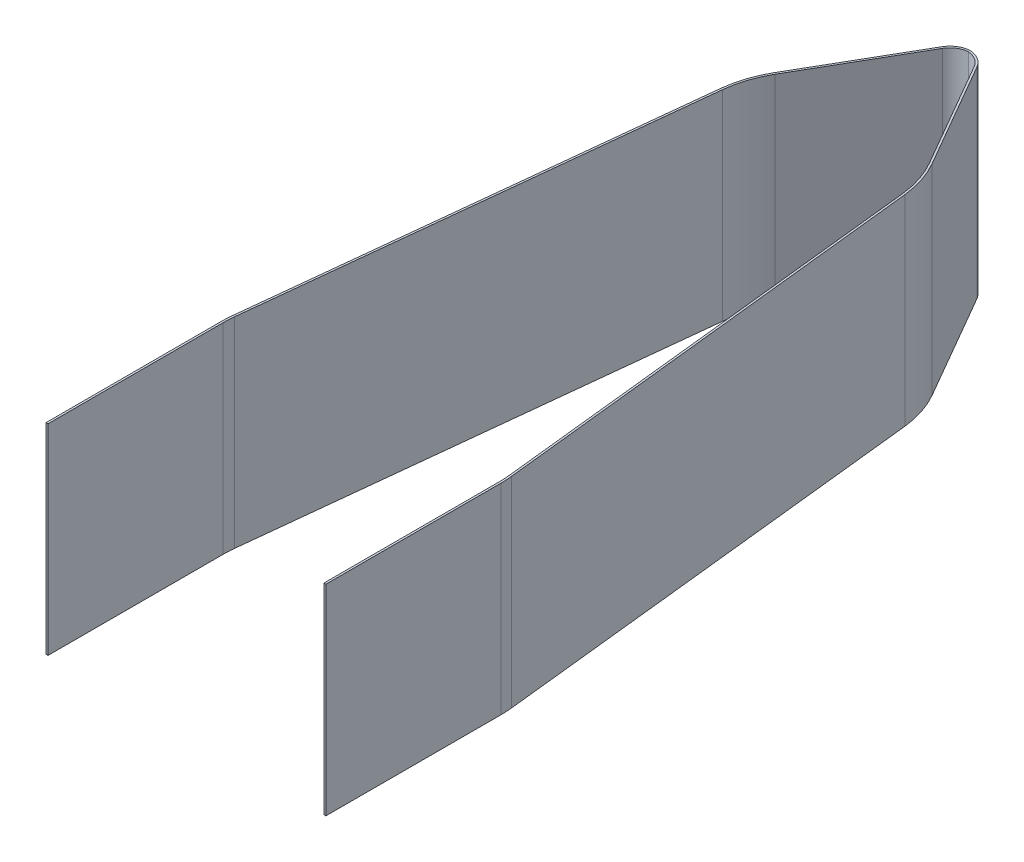
ISO-10303-21;
HEADER;
FILE_DESCRIPTION(('STEP AP214'),'2;1');
FILE_NAME('part.step','',(''),(''),'','','');
FILE_SCHEMA(('AUTOMOTIVE_DESIGN { 1 0 10303 214 1 1 1 1 }'));
ENDSEC;
DATA;
#1=APPLICATION_CONTEXT('core data for automotive mechanical design processes');
#2=APPLICATION_PROTOCOL_DEFINITION('international standard','automotive_design',2000,#1);
#3=PRODUCT_CONTEXT('',#1,'mechanical');
#4=PRODUCT('Part','Part','',(#3));
#5=PRODUCT_RELATED_PRODUCT_CATEGORY('part','',(#4));
#6=PRODUCT_DEFINITION_FORMATION('','',#4);
#7=PRODUCT_DEFINITION_CONTEXT('part definition',#1,'design');
#8=PRODUCT_DEFINITION('design','',#6,#7);
#9=PRODUCT_DEFINITION_SHAPE('','',#8);
#10=(LENGTH_UNIT() NAMED_UNIT(*) SI_UNIT(.MILLI.,.METRE.));
#11=(NAMED_UNIT(*) PLANE_ANGLE_UNIT() SI_UNIT($,.RADIAN.));
#12=(NAMED_UNIT(*) SI_UNIT($,.STERADIAN.) SOLID_ANGLE_UNIT());
#13=UNCERTAINTY_MEASURE_WITH_UNIT(LENGTH_MEASURE(1.E-05),#10,'distance_accuracy_value','');
#14=(GEOMETRIC_REPRESENTATION_CONTEXT(3) GLOBAL_UNCERTAINTY_ASSIGNED_CONTEXT((#13)) GLOBAL_UNIT_ASSIGNED_CONTEXT((#10,
#11,#12)) REPRESENTATION_CONTEXT('',''));
#15=CARTESIAN_POINT('',(0.,0.,0.));
#16=DIRECTION('',(0.,0.,1.));
#17=DIRECTION('',(1.,0.,0.));
#18=AXIS2_PLACEMENT_3D('',#15,#16,#17);
#19=CARTESIAN_POINT('',(4.7625,12.7,-24.7202799887067));
#20=DIRECTION('',(0.,-1.,0.));
#21=DIRECTION('',(0.,0.,-1.));
#22=AXIS2_PLACEMENT_3D('',#19,#20,#21);
#23=CYLINDRICAL_SURFACE('',#22,12.7);
#24=DIRECTION('',(0.,1.,0.));
#25=VECTOR('',#24,1.);
#26=CARTESIAN_POINT('',(17.4625,12.7,-24.7202799887067));
#27=LINE('',#26,#25);
#28=CARTESIAN_POINT('',(17.4625,-12.7,-24.7202799887067));
#29=VERTEX_POINT('',#28);
#30=CARTESIAN_POINT('',(17.4625,12.7,-24.7202799887067));
#31=VERTEX_POINT('',#30);
#32=EDGE_CURVE('E350',#29,#31,#27,.T.);
#33=ORIENTED_EDGE('',*,*,#32,.T.);
#34=CARTESIAN_POINT('',(4.7625,12.7,-24.7202799887067));
#35=DIRECTION('',(0.,-1.,0.));
#36=DIRECTION('',(0.,0.,-1.));
#37=AXIS2_PLACEMENT_3D('',#34,#35,#36);
#38=CIRCLE('',#37,12.7);
#39=CARTESIAN_POINT('',(17.3899488806237,12.7,-26.0758369839065));
#40=VERTEX_POINT('',#39);
#41=EDGE_CURVE('E19',#40,#31,#38,.T.);
#42=ORIENTED_EDGE('',*,*,#41,.F.);
#43=DIRECTION('',(0.,1.,0.));
#44=VECTOR('',#43,1.);
#45=CARTESIAN_POINT('',(17.3899488806237,12.7,-26.0758369839065));
#46=LINE('',#45,#44);
#47=CARTESIAN_POINT('',(17.3899488806237,-12.7,-26.0758369839065));
#48=VERTEX_POINT('',#47);
#49=EDGE_CURVE('E352',#40,#48,#46,.F.);
#50=ORIENTED_EDGE('',*,*,#49,.T.);
#51=CARTESIAN_POINT('',(4.7625,-12.7,-24.7202799887067));
#52=DIRECTION('',(0.,-1.,0.));
#53=DIRECTION('',(0.,0.,-1.));
#54=AXIS2_PLACEMENT_3D('',#51,#52,#53);
#55=CIRCLE('',#54,12.7);
#56=EDGE_CURVE('E394',#29,#48,#55,.F.);
#57=ORIENTED_EDGE('',*,*,#56,.F.);
#58=EDGE_LOOP('',(#33,#42,#50,#57));
#59=FACE_BOUND('',#58,.T.);
#60=ADVANCED_FACE('F16',(#59),#23,.F.);
#61=CARTESIAN_POINT('',(17.4625,12.7,-2.53999999999484));
#62=DIRECTION('',(0.,0.,-1.));
#63=DIRECTION('',(-1.,0.,0.));
#64=AXIS2_PLACEMENT_3D('',#61,#62,#63);
#65=PLANE('',#64);
#66=DIRECTION('',(0.,1.,0.));
#67=VECTOR('',#66,1.);
#68=CARTESIAN_POINT('',(17.7165,12.7,-2.53999999999484));
#69=LINE('',#68,#67);
#70=CARTESIAN_POINT('',(17.7165,-12.7,-2.53999999999484));
#71=VERTEX_POINT('',#70);
#72=CARTESIAN_POINT('',(17.7165,12.7,-2.53999999999484));
#73=VERTEX_POINT('',#72);
#74=EDGE_CURVE('E345',#71,#73,#69,.T.);
#75=ORIENTED_EDGE('',*,*,#74,.T.);
#76=DIRECTION('',(-1.,0.,0.));
#77=VECTOR('',#76,1.);
#78=CARTESIAN_POINT('',(17.4625,12.7,-2.53999999999484));
#79=LINE('',#78,#77);
#80=CARTESIAN_POINT('',(17.4625,12.7,-2.53999999999484));
#81=VERTEX_POINT('',#80);
#82=EDGE_CURVE('E182',#81,#73,#79,.F.);
#83=ORIENTED_EDGE('',*,*,#82,.F.);
#84=DIRECTION('',(0.,1.,0.));
#85=VECTOR('',#84,1.);
#86=CARTESIAN_POINT('',(17.4625,12.7,-2.53999999999484));
#87=LINE('',#86,#85);
#88=CARTESIAN_POINT('',(17.4625,-12.7,-2.53999999999484));
#89=VERTEX_POINT('',#88);
#90=EDGE_CURVE('E347',#81,#89,#87,.F.);
#91=ORIENTED_EDGE('',*,*,#90,.T.);
#92=DIRECTION('',(-1.,0.,0.));
#93=VECTOR('',#92,1.);
#94=CARTESIAN_POINT('',(17.4625,-12.7,-2.53999999999484));
#95=LINE('',#94,#93);
#96=EDGE_CURVE('E388',#71,#89,#95,.T.);
#97=ORIENTED_EDGE('',*,*,#96,.F.);
#98=EDGE_LOOP('',(#75,#83,#91,#97));
#99=FACE_BOUND('',#98,.T.);
#100=ADVANCED_FACE('F514',(#99),#65,.F.);
#101=CARTESIAN_POINT('',(4.7625,12.7,-24.7202799887067));
#102=DIRECTION('',(0.,-1.,0.));
#103=DIRECTION('',(0.,0.,-1.));
#104=AXIS2_PLACEMENT_3D('',#101,#102,#103);
#105=CYLINDRICAL_SURFACE('',#104,12.954);
#106=CARTESIAN_POINT('',(4.7625,12.7,-24.7202799887067));
#107=DIRECTION('',(0.,-1.,0.));
#108=DIRECTION('',(0.,0.,-1.));
#109=AXIS2_PLACEMENT_3D('',#106,#107,#108);
#110=CIRCLE('',#109,12.954);
#111=CARTESIAN_POINT('',(17.6424978582362,12.7,-26.1029481238105));
#112=VERTEX_POINT('',#111);
#113=CARTESIAN_POINT('',(17.7165,12.7,-24.7202799887067));
#114=VERTEX_POINT('',#113);
#115=EDGE_CURVE('E385',#112,#114,#110,.T.);
#116=ORIENTED_EDGE('',*,*,#115,.T.);
#117=DIRECTION('',(0.,1.,0.));
#118=VECTOR('',#117,1.);
#119=CARTESIAN_POINT('',(17.7165,12.7,-24.7202799887067));
#120=LINE('',#119,#118);
#121=CARTESIAN_POINT('',(17.7165,-12.7,-24.7202799887067));
#122=VERTEX_POINT('',#121);
#123=EDGE_CURVE('E342',#114,#122,#120,.F.);
#124=ORIENTED_EDGE('',*,*,#123,.T.);
#125=CARTESIAN_POINT('',(4.7625,-12.7,-24.7202799887067));
#126=DIRECTION('',(0.,-1.,0.));
#127=DIRECTION('',(0.,0.,-1.));
#128=AXIS2_PLACEMENT_3D('',#125,#126,#127);
#129=CIRCLE('',#128,12.954);
#130=CARTESIAN_POINT('',(17.6424978582362,-12.7,-26.1029481238105));
#131=VERTEX_POINT('',#130);
#132=EDGE_CURVE('E390',#122,#131,#129,.F.);
#133=ORIENTED_EDGE('',*,*,#132,.T.);
#134=DIRECTION('',(0.,1.,0.));
#135=VECTOR('',#134,1.);
#136=CARTESIAN_POINT('',(17.6424978582362,12.7,-26.1029481238105));
#137=LINE('',#136,#135);
#138=EDGE_CURVE('E339',#131,#112,#137,.T.);
#139=ORIENTED_EDGE('',*,*,#138,.T.);
#140=EDGE_LOOP('',(#116,#124,#133,#139));
#141=FACE_BOUND('',#140,.T.);
#142=ADVANCED_FACE('F509',(#141),#105,.T.);
#143=CARTESIAN_POINT('',(-17.4625,12.7,-2.53999999999483));
#144=DIRECTION('',(0.,0.,-1.));
#145=DIRECTION('',(-1.,0.,0.));
#146=AXIS2_PLACEMENT_3D('',#143,#144,#145);
#147=PLANE('',#146);
#148=DIRECTION('',(0.,1.,0.));
#149=VECTOR('',#148,1.);
#150=CARTESIAN_POINT('',(-17.4625,12.7,-2.53999999999483));
#151=LINE('',#150,#149);
#152=CARTESIAN_POINT('',(-17.4625,-12.7,-2.53999999999483));
#153=VERTEX_POINT('',#152);
#154=CARTESIAN_POINT('',(-17.4625,12.7,-2.53999999999483));
#155=VERTEX_POINT('',#154);
#156=EDGE_CURVE('E217',#153,#155,#151,.T.);
#157=ORIENTED_EDGE('',*,*,#156,.T.);
#158=DIRECTION('',(-1.,0.,0.));
#159=VECTOR('',#158,1.);
#160=CARTESIAN_POINT('',(-17.4625,12.7,-2.53999999999483));
#161=LINE('',#160,#159);
#162=CARTESIAN_POINT('',(-17.7165,12.7,-2.53999999999483));
#163=VERTEX_POINT('',#162);
#164=EDGE_CURVE('E209',#163,#155,#161,.F.);
#165=ORIENTED_EDGE('',*,*,#164,.F.);
#166=DIRECTION('',(0.,1.,0.));
#167=VECTOR('',#166,1.);
#168=CARTESIAN_POINT('',(-17.7165,12.7,-2.53999999999483));
#169=LINE('',#168,#167);
#170=CARTESIAN_POINT('',(-17.7165,-12.7,-2.53999999999483));
#171=VERTEX_POINT('',#170);
#172=EDGE_CURVE('E212',#163,#171,#169,.F.);
#173=ORIENTED_EDGE('',*,*,#172,.T.);
#174=DIRECTION('',(-1.,0.,0.));
#175=VECTOR('',#174,1.);
#176=CARTESIAN_POINT('',(-17.4625,-12.7,-2.53999999999483));
#177=LINE('',#176,#175);
#178=EDGE_CURVE('E198',#153,#171,#177,.T.);
#179=ORIENTED_EDGE('',*,*,#178,.F.);
#180=EDGE_LOOP('',(#157,#165,#173,#179));
#181=FACE_BOUND('',#180,.T.);
#182=ADVANCED_FACE('F213',(#181),#147,.F.);
#183=CARTESIAN_POINT('',(-4.7625,12.7,-24.7202799887067));
#184=DIRECTION('',(0.,-1.,0.));
#185=DIRECTION('',(0.,0.,-1.));
#186=AXIS2_PLACEMENT_3D('',#183,#184,#185);
#187=CYLINDRICAL_SURFACE('',#186,12.7);
#188=DIRECTION('',(0.,1.,0.));
#189=VECTOR('',#188,1.);
#190=CARTESIAN_POINT('',(-17.3899488806237,12.7,-26.0758369839065));
#191=LINE('',#190,#189);
#192=CARTESIAN_POINT('',(-17.3899488806237,-12.7,-26.0758369839065));
#193=VERTEX_POINT('',#192);
#194=CARTESIAN_POINT('',(-17.3899488806237,12.7,-26.0758369839065));
#195=VERTEX_POINT('',#194);
#196=EDGE_CURVE('E378',#193,#195,#191,.T.);
#197=ORIENTED_EDGE('',*,*,#196,.T.);
#198=CARTESIAN_POINT('',(-4.7625,12.7,-24.7202799887067));
#199=DIRECTION('',(0.,-1.,0.));
#200=DIRECTION('',(0.,0.,-1.));
#201=AXIS2_PLACEMENT_3D('',#198,#199,#200);
#202=CIRCLE('',#201,12.7);
#203=CARTESIAN_POINT('',(-17.4625,12.7,-24.7202799887067));
#204=VERTEX_POINT('',#203);
#205=EDGE_CURVE('E208',#204,#195,#202,.T.);
#206=ORIENTED_EDGE('',*,*,#205,.F.);
#207=DIRECTION('',(0.,1.,0.));
#208=VECTOR('',#207,1.);
#209=CARTESIAN_POINT('',(-17.4625,12.7,-24.7202799887067));
#210=LINE('',#209,#208);
#211=CARTESIAN_POINT('',(-17.4625,-12.7,-24.7202799887067));
#212=VERTEX_POINT('',#211);
#213=EDGE_CURVE('E318',#204,#212,#210,.F.);
#214=ORIENTED_EDGE('',*,*,#213,.T.);
#215=CARTESIAN_POINT('',(-4.7625,-12.7,-24.7202799887067));
#216=DIRECTION('',(0.,-1.,0.));
#217=DIRECTION('',(0.,0.,-1.));
#218=AXIS2_PLACEMENT_3D('',#215,#216,#217);
#219=CIRCLE('',#218,12.7);
#220=EDGE_CURVE('E380',#193,#212,#219,.F.);
#221=ORIENTED_EDGE('',*,*,#220,.F.);
#222=EDGE_LOOP('',(#197,#206,#214,#221));
#223=FACE_BOUND('',#222,.T.);
#224=ADVANCED_FACE('F462',(#223),#187,.F.);
#225=CARTESIAN_POINT('',(-17.3899488806237,12.7,-26.0758369839065));
#226=DIRECTION('',(-0.994287313434937,0.,-0.106736771275578));
#227=DIRECTION('',(-0.106736771275578,0.,0.994287313434937));
#228=AXIS2_PLACEMENT_3D('',#225,#226,#227);
#229=PLANE('',#228);
#230=DIRECTION('',(0.,-1.,0.));
#231=VECTOR('',#230,1.);
#232=CARTESIAN_POINT('',(-11.3990597357465,12.7,-81.8828939312004));
#233=LINE('',#232,#231);
#234=CARTESIAN_POINT('',(-11.3990597357465,-12.7,-81.8828939312004));
#235=VERTEX_POINT('',#234);
#236=CARTESIAN_POINT('',(-11.3990597357465,12.7,-81.8828939312004));
#237=VERTEX_POINT('',#236);
#238=EDGE_CURVE('E375',#235,#237,#233,.F.);
#239=ORIENTED_EDGE('',*,*,#238,.T.);
#240=DIRECTION('',(0.106736771275578,0.,-0.994287313434937));
#241=VECTOR('',#240,1.);
#242=CARTESIAN_POINT('',(-17.3899488806237,12.7,-26.0758369839065));
#243=LINE('',#242,#241);
#244=EDGE_CURVE('E315',#195,#237,#243,.T.);
#245=ORIENTED_EDGE('',*,*,#244,.F.);
#246=ORIENTED_EDGE('',*,*,#196,.F.);
#247=DIRECTION('',(0.106736771275578,0.,-0.994287313434937));
#248=VECTOR('',#247,1.);
#249=CARTESIAN_POINT('',(-17.3899488806237,-12.7,-26.0758369839065));
#250=LINE('',#249,#248);
#251=EDGE_CURVE('E267',#193,#235,#250,.T.);
#252=ORIENTED_EDGE('',*,*,#251,.T.);
#253=EDGE_LOOP('',(#239,#245,#246,#252));
#254=FACE_BOUND('',#253,.T.);
#255=ADVANCED_FACE('F458',(#254),#229,.F.);
#256=CARTESIAN_POINT('',(1.22838914487718,12.7,-80.5273369360006));
#257=DIRECTION('',(0.,-1.,0.));
#258=DIRECTION('',(0.,0.,-1.));
#259=AXIS2_PLACEMENT_3D('',#256,#257,#258);
#260=CYLINDRICAL_SURFACE('',#259,12.7);
#261=DIRECTION('',(0.,1.,0.));
#262=VECTOR('',#261,1.);
#263=CARTESIAN_POINT('',(-9.77013348318521,12.7,-86.8773369360005));
#264=LINE('',#263,#262);
#265=CARTESIAN_POINT('',(-9.77013348318521,-12.7,-86.8773369360005));
#266=VERTEX_POINT('',#265);
#267=CARTESIAN_POINT('',(-9.77013348318521,12.7,-86.8773369360005));
#268=VERTEX_POINT('',#267);
#269=EDGE_CURVE('E372',#266,#268,#264,.T.);
#270=ORIENTED_EDGE('',*,*,#269,.T.);
#271=CARTESIAN_POINT('',(1.22838914487718,12.7,-80.5273369360006));
#272=DIRECTION('',(0.,-1.,0.));
#273=DIRECTION('',(0.,0.,-1.));
#274=AXIS2_PLACEMENT_3D('',#271,#272,#273);
#275=CIRCLE('',#274,12.7);
#276=EDGE_CURVE('E314',#237,#268,#275,.T.);
#277=ORIENTED_EDGE('',*,*,#276,.F.);
#278=ORIENTED_EDGE('',*,*,#238,.F.);
#279=CARTESIAN_POINT('',(1.22838914487718,-12.7,-80.5273369360006));
#280=DIRECTION('',(0.,-1.,0.));
#281=DIRECTION('',(0.,0.,-1.));
#282=AXIS2_PLACEMENT_3D('',#279,#280,#281);
#283=CIRCLE('',#282,12.7);
#284=EDGE_CURVE('E266',#235,#266,#283,.T.);
#285=ORIENTED_EDGE('',*,*,#284,.T.);
#286=EDGE_LOOP('',(#270,#277,#278,#285));
#287=FACE_BOUND('',#286,.T.);
#288=ADVANCED_FACE('F454',(#287),#260,.F.);
#289=CARTESIAN_POINT('',(-9.77013348318521,12.7,-86.8773369360005));
#290=DIRECTION('',(-0.86602540378444,0.,-0.499999999999998));
#291=DIRECTION('',(-0.499999999999998,0.,0.86602540378444));
#292=AXIS2_PLACEMENT_3D('',#289,#290,#291);
#293=PLANE('',#292);
#294=DIRECTION('',(0.,-1.,0.));
#295=VECTOR('',#294,1.);
#296=CARTESIAN_POINT('',(-2.00323484187083,12.7,-100.329999999995));
#297=LINE('',#296,#295);
#298=CARTESIAN_POINT('',(-2.00323484187082,-12.7,-100.329999999995));
#299=VERTEX_POINT('',#298);
#300=CARTESIAN_POINT('',(-2.00323484187082,12.7,-100.329999999995));
#301=VERTEX_POINT('',#300);
#302=EDGE_CURVE('E369',#299,#301,#297,.F.);
#303=ORIENTED_EDGE('',*,*,#302,.T.);
#304=DIRECTION('',(0.499999999999998,0.,-0.86602540378444));
#305=VECTOR('',#304,1.);
#306=CARTESIAN_POINT('',(-9.77013348318521,12.7,-86.8773369360005));
#307=LINE('',#306,#305);
#308=EDGE_CURVE('E311',#268,#301,#307,.T.);
#309=ORIENTED_EDGE('',*,*,#308,.F.);
#310=ORIENTED_EDGE('',*,*,#269,.F.);
#311=DIRECTION('',(0.499999999999998,0.,-0.86602540378444));
#312=VECTOR('',#311,1.);
#313=CARTESIAN_POINT('',(-9.77013348318521,-12.7,-86.8773369360005));
#314=LINE('',#313,#312);
#315=EDGE_CURVE('E262',#266,#299,#314,.T.);
#316=ORIENTED_EDGE('',*,*,#315,.T.);
#317=EDGE_LOOP('',(#303,#309,#310,#316));
#318=FACE_BOUND('',#317,.T.);
#319=ADVANCED_FACE('F450',(#318),#293,.F.);
#320=CARTESIAN_POINT('',(0.196469683741654,12.7,-99.0599999999948));
#321=DIRECTION('',(0.,-1.,0.));
#322=DIRECTION('',(0.,0.,-1.));
#323=AXIS2_PLACEMENT_3D('',#320,#321,#322);
#324=CYLINDRICAL_SURFACE('',#323,2.54);
#325=DIRECTION('',(0.,-1.,0.));
#326=VECTOR('',#325,1.);
#327=CARTESIAN_POINT('',(0.,12.7,-101.592390108839));
#328=LINE('',#327,#326);
#329=CARTESIAN_POINT('',(0.,-12.7,-101.592390108839));
#330=VERTEX_POINT('',#329);
#331=CARTESIAN_POINT('',(0.,12.7,-101.592390108839));
#332=VERTEX_POINT('',#331);
#333=EDGE_CURVE('E366',#330,#332,#328,.F.);
#334=ORIENTED_EDGE('',*,*,#333,.T.);
#335=CARTESIAN_POINT('',(0.196469683741654,12.7,-99.0599999999948));
#336=DIRECTION('',(0.,-1.,0.));
#337=DIRECTION('',(0.,0.,-1.));
#338=AXIS2_PLACEMENT_3D('',#335,#336,#337);
#339=CIRCLE('',#338,2.54);
#340=EDGE_CURVE('E313',#301,#332,#339,.T.);
#341=ORIENTED_EDGE('',*,*,#340,.F.);
#342=ORIENTED_EDGE('',*,*,#302,.F.);
#343=CARTESIAN_POINT('',(0.196469683741654,-12.7,-99.0599999999948));
#344=DIRECTION('',(0.,-1.,0.));
#345=DIRECTION('',(0.,0.,-1.));
#346=AXIS2_PLACEMENT_3D('',#343,#344,#345);
#347=CIRCLE('',#346,2.54);
#348=EDGE_CURVE('E265',#299,#330,#347,.T.);
#349=ORIENTED_EDGE('',*,*,#348,.T.);
#350=EDGE_LOOP('',(#334,#341,#342,#349));
#351=FACE_BOUND('',#350,.T.);
#352=ADVANCED_FACE('F446',(#351),#324,.F.);
#353=CARTESIAN_POINT('',(-0.196469683741655,12.7,-99.0599999999948));
#354=DIRECTION('',(0.,-1.,0.));
#355=DIRECTION('',(0.,0.,-1.));
#356=AXIS2_PLACEMENT_3D('',#353,#354,#355);
#357=CYLINDRICAL_SURFACE('',#356,2.54);
#358=DIRECTION('',(0.,1.,0.));
#359=VECTOR('',#358,1.);
#360=CARTESIAN_POINT('',(2.00323484187082,12.7,-100.329999999995));
#361=LINE('',#360,#359);
#362=CARTESIAN_POINT('',(2.00323484187082,-12.7,-100.329999999995));
#363=VERTEX_POINT('',#362);
#364=CARTESIAN_POINT('',(2.00323484187082,12.7,-100.329999999995));
#365=VERTEX_POINT('',#364);
#366=EDGE_CURVE('E363',#363,#365,#361,.T.);
#367=ORIENTED_EDGE('',*,*,#366,.T.);
#368=CARTESIAN_POINT('',(-0.196469683741655,12.7,-99.0599999999948));
#369=DIRECTION('',(0.,-1.,0.));
#370=DIRECTION('',(0.,0.,-1.));
#371=AXIS2_PLACEMENT_3D('',#368,#369,#370);
#372=CIRCLE('',#371,2.54);
#373=EDGE_CURVE('E310',#332,#365,#372,.T.);
#374=ORIENTED_EDGE('',*,*,#373,.F.);
#375=ORIENTED_EDGE('',*,*,#333,.F.);
#376=CARTESIAN_POINT('',(-0.196469683741655,-12.7,-99.0599999999948));
#377=DIRECTION('',(0.,-1.,0.));
#378=DIRECTION('',(0.,0.,-1.));
#379=AXIS2_PLACEMENT_3D('',#376,#377,#378);
#380=CIRCLE('',#379,2.54);
#381=EDGE_CURVE('E261',#330,#363,#380,.T.);
#382=ORIENTED_EDGE('',*,*,#381,.T.);
#383=EDGE_LOOP('',(#367,#374,#375,#382));
#384=FACE_BOUND('',#383,.T.);
#385=ADVANCED_FACE('F442',(#384),#357,.F.);
#386=CARTESIAN_POINT('',(2.00323484187082,12.7,-100.329999999995));
#387=DIRECTION('',(0.86602540378444,0.,-0.499999999999998));
#388=DIRECTION('',(-0.499999999999998,0.,-0.86602540378444));
#389=AXIS2_PLACEMENT_3D('',#386,#387,#388);
#390=PLANE('',#389);
#391=DIRECTION('',(0.,-1.,0.));
#392=VECTOR('',#391,1.);
#393=CARTESIAN_POINT('',(9.77013348318521,12.7,-86.8773369360005));
#394=LINE('',#393,#392);
#395=CARTESIAN_POINT('',(9.77013348318521,-12.7,-86.8773369360005));
#396=VERTEX_POINT('',#395);
#397=CARTESIAN_POINT('',(9.77013348318521,12.7,-86.8773369360005));
#398=VERTEX_POINT('',#397);
#399=EDGE_CURVE('E359',#396,#398,#394,.F.);
#400=ORIENTED_EDGE('',*,*,#399,.T.);
#401=DIRECTION('',(0.499999999999998,0.,0.86602540378444));
#402=VECTOR('',#401,1.);
#403=CARTESIAN_POINT('',(2.00323484187082,12.7,-100.329999999995));
#404=LINE('',#403,#402);
#405=EDGE_CURVE('E308',#365,#398,#404,.T.);
#406=ORIENTED_EDGE('',*,*,#405,.F.);
#407=ORIENTED_EDGE('',*,*,#366,.F.);
#408=DIRECTION('',(0.499999999999998,0.,0.86602540378444));
#409=VECTOR('',#408,1.);
#410=CARTESIAN_POINT('',(2.00323484187082,-12.7,-100.329999999995));
#411=LINE('',#410,#409);
#412=EDGE_CURVE('E258',#363,#396,#411,.T.);
#413=ORIENTED_EDGE('',*,*,#412,.T.);
#414=EDGE_LOOP('',(#400,#406,#407,#413));
#415=FACE_BOUND('',#414,.T.);
#416=ADVANCED_FACE('F438',(#415),#390,.F.);
#417=CARTESIAN_POINT('',(-1.22838914487718,12.7,-80.5273369360006));
#418=DIRECTION('',(0.,-1.,0.));
#419=DIRECTION('',(0.,0.,-1.));
#420=AXIS2_PLACEMENT_3D('',#417,#418,#419);
#421=CYLINDRICAL_SURFACE('',#420,12.7);
#422=DIRECTION('',(0.,1.,0.));
#423=VECTOR('',#422,1.);
#424=CARTESIAN_POINT('',(11.3990597357465,12.7,-81.8828939312004));
#425=LINE('',#424,#423);
#426=CARTESIAN_POINT('',(11.3990597357465,-12.7,-81.8828939312004));
#427=VERTEX_POINT('',#426);
#428=CARTESIAN_POINT('',(11.3990597357465,12.7,-81.8828939312004));
#429=VERTEX_POINT('',#428);
#430=EDGE_CURVE('E356',#427,#429,#425,.T.);
#431=ORIENTED_EDGE('',*,*,#430,.T.);
#432=CARTESIAN_POINT('',(-1.22838914487718,12.7,-80.5273369360006));
#433=DIRECTION('',(0.,-1.,0.));
#434=DIRECTION('',(0.,0.,-1.));
#435=AXIS2_PLACEMENT_3D('',#432,#433,#434);
#436=CIRCLE('',#435,12.7);
#437=EDGE_CURVE('E307',#398,#429,#436,.T.);
#438=ORIENTED_EDGE('',*,*,#437,.F.);
#439=ORIENTED_EDGE('',*,*,#399,.F.);
#440=CARTESIAN_POINT('',(-1.22838914487718,-12.7,-80.5273369360006));
#441=DIRECTION('',(0.,-1.,0.));
#442=DIRECTION('',(0.,0.,-1.));
#443=AXIS2_PLACEMENT_3D('',#440,#441,#442);
#444=CIRCLE('',#443,12.7);
#445=EDGE_CURVE('E257',#396,#427,#444,.T.);
#446=ORIENTED_EDGE('',*,*,#445,.T.);
#447=EDGE_LOOP('',(#431,#438,#439,#446));
#448=FACE_BOUND('',#447,.T.);
#449=ADVANCED_FACE('F434',(#448),#421,.F.);
#450=CARTESIAN_POINT('',(11.3990597357465,12.7,-81.8828939312004));
#451=DIRECTION('',(0.994287313434937,0.,-0.106736771275578));
#452=DIRECTION('',(-0.106736771275578,0.,-0.994287313434937));
#453=AXIS2_PLACEMENT_3D('',#450,#451,#452);
#454=PLANE('',#453);
#455=ORIENTED_EDGE('',*,*,#49,.F.);
#456=DIRECTION('',(0.106736771275578,0.,0.994287313434937));
#457=VECTOR('',#456,1.);
#458=CARTESIAN_POINT('',(11.3990597357465,12.7,-81.8828939312004));
#459=LINE('',#458,#457);
#460=EDGE_CURVE('E303',#429,#40,#459,.T.);
#461=ORIENTED_EDGE('',*,*,#460,.F.);
#462=ORIENTED_EDGE('',*,*,#430,.F.);
#463=DIRECTION('',(0.106736771275578,0.,0.994287313434937));
#464=VECTOR('',#463,1.);
#465=CARTESIAN_POINT('',(11.3990597357465,-12.7,-81.8828939312004));
#466=LINE('',#465,#464);
#467=EDGE_CURVE('E252',#427,#48,#466,.T.);
#468=ORIENTED_EDGE('',*,*,#467,.T.);
#469=EDGE_LOOP('',(#455,#461,#462,#468));
#470=FACE_BOUND('',#469,.T.);
#471=ADVANCED_FACE('F431',(#470),#454,.F.);
#472=CARTESIAN_POINT('',(17.4625,12.7,-24.7202799887067));
#473=DIRECTION('',(1.,0.,0.));
#474=DIRECTION('',(0.,0.,-1.));
#475=AXIS2_PLACEMENT_3D('',#472,#473,#474);
#476=PLANE('',#475);
#477=ORIENTED_EDGE('',*,*,#90,.F.);
#478=DIRECTION('',(0.,0.,1.));
#479=VECTOR('',#478,1.);
#480=CARTESIAN_POINT('',(17.4625,12.7,-24.7202799887067));
#481=LINE('',#480,#479);
#482=EDGE_CURVE('E299',#31,#81,#481,.T.);
#483=ORIENTED_EDGE('',*,*,#482,.F.);
#484=ORIENTED_EDGE('',*,*,#32,.F.);
#485=DIRECTION('',(0.,0.,1.));
#486=VECTOR('',#485,1.);
#487=CARTESIAN_POINT('',(17.4625,-12.7,-24.7202799887067));
#488=LINE('',#487,#486);
#489=EDGE_CURVE('E247',#29,#89,#488,.T.);
#490=ORIENTED_EDGE('',*,*,#489,.T.);
#491=EDGE_LOOP('',(#477,#483,#484,#490));
#492=FACE_BOUND('',#491,.T.);
#493=ADVANCED_FACE('F517',(#492),#476,.F.);
#494=CARTESIAN_POINT('',(17.7165,12.7,-24.7202799887067));
#495=DIRECTION('',(-1.,0.,0.));
#496=DIRECTION('',(0.,0.,1.));
#497=AXIS2_PLACEMENT_3D('',#494,#495,#496);
#498=PLANE('',#497);
#499=ORIENTED_EDGE('',*,*,#123,.F.);
#500=DIRECTION('',(0.,0.,1.));
#501=VECTOR('',#500,1.);
#502=CARTESIAN_POINT('',(17.7165,12.7,-24.7202799887067));
#503=LINE('',#502,#501);
#504=EDGE_CURVE('E297',#73,#114,#503,.F.);
#505=ORIENTED_EDGE('',*,*,#504,.F.);
#506=ORIENTED_EDGE('',*,*,#74,.F.);
#507=DIRECTION('',(0.,0.,1.));
#508=VECTOR('',#507,1.);
#509=CARTESIAN_POINT('',(17.7165,-12.7,-24.7202799887067));
#510=LINE('',#509,#508);
#511=EDGE_CURVE('E244',#71,#122,#510,.F.);
#512=ORIENTED_EDGE('',*,*,#511,.T.);
#513=EDGE_LOOP('',(#499,#505,#506,#512));
#514=FACE_BOUND('',#513,.T.);
#515=ADVANCED_FACE('F513',(#514),#498,.F.);
#516=CARTESIAN_POINT('',(11.651608713359,12.7,-81.9100050711044));
#517=DIRECTION('',(-0.994287313434937,0.,0.106736771275578));
#518=DIRECTION('',(0.106736771275578,0.,0.994287313434937));
#519=AXIS2_PLACEMENT_3D('',#516,#517,#518);
#520=PLANE('',#519);
#521=DIRECTION('',(0.,-1.,0.));
#522=VECTOR('',#521,1.);
#523=CARTESIAN_POINT('',(11.651608713359,12.7,-81.9100050711044));
#524=LINE('',#523,#522);
#525=CARTESIAN_POINT('',(11.651608713359,12.7,-81.9100050711044));
#526=VERTEX_POINT('',#525);
#527=CARTESIAN_POINT('',(11.651608713359,-12.7,-81.9100050711044));
#528=VERTEX_POINT('',#527);
#529=EDGE_CURVE('E337',#526,#528,#524,.T.);
#530=ORIENTED_EDGE('',*,*,#529,.F.);
#531=DIRECTION('',(-0.106736771275578,0.,-0.994287313434937));
#532=VECTOR('',#531,1.);
#533=CARTESIAN_POINT('',(17.6424978582362,12.7,-26.1029481238105));
#534=LINE('',#533,#532);
#535=EDGE_CURVE('E295',#112,#526,#534,.T.);
#536=ORIENTED_EDGE('',*,*,#535,.F.);
#537=ORIENTED_EDGE('',*,*,#138,.F.);
#538=DIRECTION('',(-0.106736771275578,0.,-0.994287313434937));
#539=VECTOR('',#538,1.);
#540=CARTESIAN_POINT('',(17.6424978582362,-12.7,-26.1029481238105));
#541=LINE('',#540,#539);
#542=EDGE_CURVE('E241',#131,#528,#541,.T.);
#543=ORIENTED_EDGE('',*,*,#542,.T.);
#544=EDGE_LOOP('',(#530,#536,#537,#543));
#545=FACE_BOUND('',#544,.T.);
#546=ADVANCED_FACE('F504',(#545),#520,.F.);
#547=CARTESIAN_POINT('',(-1.22838914487718,12.7,-80.5273369360006));
#548=DIRECTION('',(0.,-1.,0.));
#549=DIRECTION('',(0.,0.,-1.));
#550=AXIS2_PLACEMENT_3D('',#547,#548,#549);
#551=CYLINDRICAL_SURFACE('',#550,12.954);
#552=CARTESIAN_POINT('',(-1.22838914487718,12.7,-80.5273369360006));
#553=DIRECTION('',(0.,-1.,0.));
#554=DIRECTION('',(0.,0.,-1.));
#555=AXIS2_PLACEMENT_3D('',#552,#553,#554);
#556=CIRCLE('',#555,12.954);
#557=CARTESIAN_POINT('',(9.99010393574646,12.7,-87.0043369360005));
#558=VERTEX_POINT('',#557);
#559=EDGE_CURVE('E294',#526,#558,#556,.F.);
#560=ORIENTED_EDGE('',*,*,#559,.F.);
#561=ORIENTED_EDGE('',*,*,#529,.T.);
#562=CARTESIAN_POINT('',(-1.22838914487718,-12.7,-80.5273369360006));
#563=DIRECTION('',(0.,-1.,0.));
#564=DIRECTION('',(0.,0.,-1.));
#565=AXIS2_PLACEMENT_3D('',#562,#563,#564);
#566=CIRCLE('',#565,12.954);
#567=CARTESIAN_POINT('',(9.99010393574646,-12.7,-87.0043369360005));
#568=VERTEX_POINT('',#567);
#569=EDGE_CURVE('E240',#528,#568,#566,.F.);
#570=ORIENTED_EDGE('',*,*,#569,.T.);
#571=DIRECTION('',(0.,1.,0.));
#572=VECTOR('',#571,1.);
#573=CARTESIAN_POINT('',(9.99010393574646,12.7,-87.0043369360005));
#574=LINE('',#573,#572);
#575=EDGE_CURVE('E334',#568,#558,#574,.T.);
#576=ORIENTED_EDGE('',*,*,#575,.T.);
#577=EDGE_LOOP('',(#560,#561,#570,#576));
#578=FACE_BOUND('',#577,.T.);
#579=ADVANCED_FACE('F500',(#578),#551,.T.);
#580=CARTESIAN_POINT('',(2.22320529443207,12.7,-100.456999999995));
#581=DIRECTION('',(-0.86602540378444,0.,0.499999999999998));
#582=DIRECTION('',(0.499999999999998,0.,0.86602540378444));
#583=AXIS2_PLACEMENT_3D('',#580,#581,#582);
#584=PLANE('',#583);
#585=DIRECTION('',(0.,-1.,0.));
#586=VECTOR('',#585,1.);
#587=CARTESIAN_POINT('',(2.22320529443206,12.7,-100.456999999995));
#588=LINE('',#587,#586);
#589=CARTESIAN_POINT('',(2.22320529443207,12.7,-100.456999999995));
#590=VERTEX_POINT('',#589);
#591=CARTESIAN_POINT('',(2.22320529443207,-12.7,-100.456999999995));
#592=VERTEX_POINT('',#591);
#593=EDGE_CURVE('E332',#590,#592,#588,.T.);
#594=ORIENTED_EDGE('',*,*,#593,.F.);
#595=DIRECTION('',(-0.499999999999997,0.,-0.86602540378444));
#596=VECTOR('',#595,1.);
#597=CARTESIAN_POINT('',(9.99010393574646,12.7,-87.0043369360005));
#598=LINE('',#597,#596);
#599=EDGE_CURVE('E291',#558,#590,#598,.T.);
#600=ORIENTED_EDGE('',*,*,#599,.F.);
#601=ORIENTED_EDGE('',*,*,#575,.F.);
#602=DIRECTION('',(-0.499999999999997,0.,-0.86602540378444));
#603=VECTOR('',#602,1.);
#604=CARTESIAN_POINT('',(9.99010393574646,-12.7,-87.0043369360005));
#605=LINE('',#604,#603);
#606=EDGE_CURVE('E236',#568,#592,#605,.T.);
#607=ORIENTED_EDGE('',*,*,#606,.T.);
#608=EDGE_LOOP('',(#594,#600,#601,#607));
#609=FACE_BOUND('',#608,.T.);
#610=ADVANCED_FACE('F495',(#609),#584,.F.);
#611=CARTESIAN_POINT('',(-0.196469683741655,12.7,-99.0599999999948));
#612=DIRECTION('',(0.,-1.,0.));
#613=DIRECTION('',(0.,0.,-1.));
#614=AXIS2_PLACEMENT_3D('',#611,#612,#613);
#615=CYLINDRICAL_SURFACE('',#614,2.79399999999999);
#616=CARTESIAN_POINT('',(-0.196469683741655,12.7,-99.0599999999948));
#617=DIRECTION('',(0.,-1.,0.));
#618=DIRECTION('',(0.,0.,-1.));
#619=AXIS2_PLACEMENT_3D('',#616,#617,#618);
#620=CIRCLE('',#619,2.79399999999999);
#621=CARTESIAN_POINT('',(0.,12.7,-101.847083720189));
#622=VERTEX_POINT('',#621);
#623=EDGE_CURVE('E293',#590,#622,#620,.F.);
#624=ORIENTED_EDGE('',*,*,#623,.F.);
#625=ORIENTED_EDGE('',*,*,#593,.T.);
#626=CARTESIAN_POINT('',(-0.196469683741655,-12.7,-99.0599999999948));
#627=DIRECTION('',(0.,-1.,0.));
#628=DIRECTION('',(0.,0.,-1.));
#629=AXIS2_PLACEMENT_3D('',#626,#627,#628);
#630=CIRCLE('',#629,2.79399999999999);
#631=CARTESIAN_POINT('',(0.,-12.7,-101.847083720189));
#632=VERTEX_POINT('',#631);
#633=EDGE_CURVE('E239',#592,#632,#630,.F.);
#634=ORIENTED_EDGE('',*,*,#633,.T.);
#635=DIRECTION('',(0.,-1.,0.));
#636=VECTOR('',#635,1.);
#637=CARTESIAN_POINT('',(0.,12.7,-101.847083720189));
#638=LINE('',#637,#636);
#639=EDGE_CURVE('E330',#622,#632,#638,.T.);
#640=ORIENTED_EDGE('',*,*,#639,.F.);
#641=EDGE_LOOP('',(#624,#625,#634,#640));
#642=FACE_BOUND('',#641,.T.);
#643=ADVANCED_FACE('F491',(#642),#615,.T.);
#644=CARTESIAN_POINT('',(0.196469683741654,12.7,-99.0599999999948));
#645=DIRECTION('',(0.,-1.,0.));
#646=DIRECTION('',(0.,0.,-1.));
#647=AXIS2_PLACEMENT_3D('',#644,#645,#646);
#648=CYLINDRICAL_SURFACE('',#647,2.79399999999999);
#649=CARTESIAN_POINT('',(0.196469683741654,12.7,-99.0599999999948));
#650=DIRECTION('',(0.,-1.,0.));
#651=DIRECTION('',(0.,0.,-1.));
#652=AXIS2_PLACEMENT_3D('',#649,#650,#651);
#653=CIRCLE('',#652,2.79399999999999);
#654=CARTESIAN_POINT('',(-2.22320529443207,12.7,-100.456999999995));
#655=VERTEX_POINT('',#654);
#656=EDGE_CURVE('E290',#622,#655,#653,.F.);
#657=ORIENTED_EDGE('',*,*,#656,.F.);
#658=ORIENTED_EDGE('',*,*,#639,.T.);
#659=CARTESIAN_POINT('',(0.196469683741654,-12.7,-99.0599999999948));
#660=DIRECTION('',(0.,-1.,0.));
#661=DIRECTION('',(0.,0.,-1.));
#662=AXIS2_PLACEMENT_3D('',#659,#660,#661);
#663=CIRCLE('',#662,2.79399999999999);
#664=CARTESIAN_POINT('',(-2.22320529443207,-12.7,-100.456999999995));
#665=VERTEX_POINT('',#664);
#666=EDGE_CURVE('E235',#632,#665,#663,.F.);
#667=ORIENTED_EDGE('',*,*,#666,.T.);
#668=DIRECTION('',(0.,1.,0.));
#669=VECTOR('',#668,1.);
#670=CARTESIAN_POINT('',(-2.22320529443207,12.7,-100.456999999995));
#671=LINE('',#670,#669);
#672=EDGE_CURVE('E218',#665,#655,#671,.T.);
#673=ORIENTED_EDGE('',*,*,#672,.T.);
#674=EDGE_LOOP('',(#657,#658,#667,#673));
#675=FACE_BOUND('',#674,.T.);
#676=ADVANCED_FACE('F485',(#675),#648,.T.);
#677=CARTESIAN_POINT('',(-9.99010393574646,12.7,-87.0043369360005));
#678=DIRECTION('',(0.86602540378444,0.,0.499999999999998));
#679=DIRECTION('',(0.499999999999998,0.,-0.86602540378444));
#680=AXIS2_PLACEMENT_3D('',#677,#678,#679);
#681=PLANE('',#680);
#682=DIRECTION('',(0.,-1.,0.));
#683=VECTOR('',#682,1.);
#684=CARTESIAN_POINT('',(-9.99010393574645,12.7,-87.0043369360005));
#685=LINE('',#684,#683);
#686=CARTESIAN_POINT('',(-9.99010393574646,12.7,-87.0043369360005));
#687=VERTEX_POINT('',#686);
#688=CARTESIAN_POINT('',(-9.99010393574646,-12.7,-87.0043369360005));
#689=VERTEX_POINT('',#688);
#690=EDGE_CURVE('E317',#687,#689,#685,.T.);
#691=ORIENTED_EDGE('',*,*,#690,.F.);
#692=DIRECTION('',(-0.499999999999998,0.,0.86602540378444));
#693=VECTOR('',#692,1.);
#694=CARTESIAN_POINT('',(-2.22320529443207,12.7,-100.456999999995));
#695=LINE('',#694,#693);
#696=EDGE_CURVE('E288',#655,#687,#695,.T.);
#697=ORIENTED_EDGE('',*,*,#696,.F.);
#698=ORIENTED_EDGE('',*,*,#672,.F.);
#699=DIRECTION('',(-0.499999999999998,0.,0.86602540378444));
#700=VECTOR('',#699,1.);
#701=CARTESIAN_POINT('',(-2.22320529443207,-12.7,-100.456999999995));
#702=LINE('',#701,#700);
#703=EDGE_CURVE('E232',#665,#689,#702,.T.);
#704=ORIENTED_EDGE('',*,*,#703,.T.);
#705=EDGE_LOOP('',(#691,#697,#698,#704));
#706=FACE_BOUND('',#705,.T.);
#707=ADVANCED_FACE('F480',(#706),#681,.F.);
#708=CARTESIAN_POINT('',(-17.7165,12.7,-2.53999999999483));
#709=DIRECTION('',(1.,0.,0.));
#710=DIRECTION('',(0.,0.,-1.));
#711=AXIS2_PLACEMENT_3D('',#708,#709,#710);
#712=PLANE('',#711);
#713=ORIENTED_EDGE('',*,*,#172,.F.);
#714=DIRECTION('',(0.,0.,1.));
#715=VECTOR('',#714,1.);
#716=CARTESIAN_POINT('',(-17.7165,12.7,-24.7202799887067));
#717=LINE('',#716,#715);
#718=CARTESIAN_POINT('',(-17.7165,12.7,-24.7202799887067));
#719=VERTEX_POINT('',#718);
#720=EDGE_CURVE('E281',#719,#163,#717,.T.);
#721=ORIENTED_EDGE('',*,*,#720,.F.);
#722=DIRECTION('',(0.,-1.,0.));
#723=VECTOR('',#722,1.);
#724=CARTESIAN_POINT('',(-17.7165,12.7,-24.7202799887066));
#725=LINE('',#724,#723);
#726=CARTESIAN_POINT('',(-17.7165,-12.7,-24.7202799887067));
#727=VERTEX_POINT('',#726);
#728=EDGE_CURVE('E221',#727,#719,#725,.F.);
#729=ORIENTED_EDGE('',*,*,#728,.F.);
#730=DIRECTION('',(0.,0.,1.));
#731=VECTOR('',#730,1.);
#732=CARTESIAN_POINT('',(-17.7165,-12.7,-24.7202799887067));
#733=LINE('',#732,#731);
#734=EDGE_CURVE('E202',#727,#171,#733,.T.);
#735=ORIENTED_EDGE('',*,*,#734,.T.);
#736=EDGE_LOOP('',(#713,#721,#729,#735));
#737=FACE_BOUND('',#736,.T.);
#738=ADVANCED_FACE('F220',(#737),#712,.F.);
#739=CARTESIAN_POINT('',(-17.4625,12.7,-2.53999999999483));
#740=DIRECTION('',(-1.,0.,0.));
#741=DIRECTION('',(0.,0.,1.));
#742=AXIS2_PLACEMENT_3D('',#739,#740,#741);
#743=PLANE('',#742);
#744=ORIENTED_EDGE('',*,*,#213,.F.);
#745=DIRECTION('',(0.,0.,1.));
#746=VECTOR('',#745,1.);
#747=CARTESIAN_POINT('',(-17.4625,12.7,-24.7202799887067));
#748=LINE('',#747,#746);
#749=EDGE_CURVE('E278',#155,#204,#748,.F.);
#750=ORIENTED_EDGE('',*,*,#749,.F.);
#751=ORIENTED_EDGE('',*,*,#156,.F.);
#752=DIRECTION('',(0.,0.,1.));
#753=VECTOR('',#752,1.);
#754=CARTESIAN_POINT('',(-17.4625,-12.7,-24.7202799887067));
#755=LINE('',#754,#753);
#756=EDGE_CURVE('E204',#153,#212,#755,.F.);
#757=ORIENTED_EDGE('',*,*,#756,.T.);
#758=EDGE_LOOP('',(#744,#750,#751,#757));
#759=FACE_BOUND('',#758,.T.);
#760=ADVANCED_FACE('F465',(#759),#743,.F.);
#761=CARTESIAN_POINT('',(1.22838914487718,12.7,-80.5273369360006));
#762=DIRECTION('',(0.,-1.,0.));
#763=DIRECTION('',(0.,0.,-1.));
#764=AXIS2_PLACEMENT_3D('',#761,#762,#763);
#765=CYLINDRICAL_SURFACE('',#764,12.954);
#766=CARTESIAN_POINT('',(1.22838914487718,12.7,-80.5273369360006));
#767=DIRECTION('',(0.,-1.,0.));
#768=DIRECTION('',(0.,0.,-1.));
#769=AXIS2_PLACEMENT_3D('',#766,#767,#768);
#770=CIRCLE('',#769,12.954);
#771=CARTESIAN_POINT('',(-11.651608713359,12.7,-81.9100050711044));
#772=VERTEX_POINT('',#771);
#773=EDGE_CURVE('E285',#687,#772,#770,.F.);
#774=ORIENTED_EDGE('',*,*,#773,.F.);
#775=ORIENTED_EDGE('',*,*,#690,.T.);
#776=CARTESIAN_POINT('',(1.22838914487718,-12.7,-80.5273369360006));
#777=DIRECTION('',(0.,-1.,0.));
#778=DIRECTION('',(0.,0.,-1.));
#779=AXIS2_PLACEMENT_3D('',#776,#777,#778);
#780=CIRCLE('',#779,12.954);
#781=CARTESIAN_POINT('',(-11.651608713359,-12.7,-81.9100050711044));
#782=VERTEX_POINT('',#781);
#783=EDGE_CURVE('E225',#689,#782,#780,.F.);
#784=ORIENTED_EDGE('',*,*,#783,.T.);
#785=DIRECTION('',(0.,1.,0.));
#786=VECTOR('',#785,1.);
#787=CARTESIAN_POINT('',(-11.651608713359,12.7,-81.9100050711044));
#788=LINE('',#787,#786);
#789=EDGE_CURVE('E223',#782,#772,#788,.T.);
#790=ORIENTED_EDGE('',*,*,#789,.T.);
#791=EDGE_LOOP('',(#774,#775,#784,#790));
#792=FACE_BOUND('',#791,.T.);
#793=ADVANCED_FACE('F538',(#792),#765,.T.);
#794=CARTESIAN_POINT('',(-4.7625,12.7,-24.7202799887067));
#795=DIRECTION('',(0.,1.,0.));
#796=DIRECTION('',(0.,0.,1.));
#797=AXIS2_PLACEMENT_3D('',#794,#795,#796);
#798=PLANE('',#797);
#799=ORIENTED_EDGE('',*,*,#164,.T.);
#800=ORIENTED_EDGE('',*,*,#749,.T.);
#801=ORIENTED_EDGE('',*,*,#205,.T.);
#802=ORIENTED_EDGE('',*,*,#244,.T.);
#803=ORIENTED_EDGE('',*,*,#276,.T.);
#804=ORIENTED_EDGE('',*,*,#308,.T.);
#805=ORIENTED_EDGE('',*,*,#340,.T.);
#806=ORIENTED_EDGE('',*,*,#373,.T.);
#807=ORIENTED_EDGE('',*,*,#405,.T.);
#808=ORIENTED_EDGE('',*,*,#437,.T.);
#809=ORIENTED_EDGE('',*,*,#460,.T.);
#810=ORIENTED_EDGE('',*,*,#41,.T.);
#811=ORIENTED_EDGE('',*,*,#482,.T.);
#812=ORIENTED_EDGE('',*,*,#82,.T.);
#813=ORIENTED_EDGE('',*,*,#504,.T.);
#814=ORIENTED_EDGE('',*,*,#115,.F.);
#815=ORIENTED_EDGE('',*,*,#535,.T.);
#816=ORIENTED_EDGE('',*,*,#559,.T.);
#817=ORIENTED_EDGE('',*,*,#599,.T.);
#818=ORIENTED_EDGE('',*,*,#623,.T.);
#819=ORIENTED_EDGE('',*,*,#656,.T.);
#820=ORIENTED_EDGE('',*,*,#696,.T.);
#821=ORIENTED_EDGE('',*,*,#773,.T.);
#822=DIRECTION('',(0.106736771275578,0.,-0.994287313434937));
#823=VECTOR('',#822,1.);
#824=CARTESIAN_POINT('',(-17.6424978582362,12.7,-26.1029481238105));
#825=LINE('',#824,#823);
#826=CARTESIAN_POINT('',(-17.6424978582362,12.7,-26.1029481238105));
#827=VERTEX_POINT('',#826);
#828=EDGE_CURVE('E272',#772,#827,#825,.F.);
#829=ORIENTED_EDGE('',*,*,#828,.T.);
#830=CARTESIAN_POINT('',(-4.7625,12.7,-24.7202799887067));
#831=DIRECTION('',(0.,-1.,0.));
#832=DIRECTION('',(0.,0.,-1.));
#833=AXIS2_PLACEMENT_3D('',#830,#831,#832);
#834=CIRCLE('',#833,12.954);
#835=EDGE_CURVE('E270',#719,#827,#834,.T.);
#836=ORIENTED_EDGE('',*,*,#835,.F.);
#837=ORIENTED_EDGE('',*,*,#720,.T.);
#838=EDGE_LOOP('',(#799,#800,#801,#802,#803,#804,#805,#806,#807,#808,#809,#810,#811,#812,#813,
#814,#815,#816,#817,#818,#819,#820,#821,#829,#836,#837));
#839=FACE_BOUND('',#838,.T.);
#840=ADVANCED_FACE('F466',(#839),#798,.T.);
#841=CARTESIAN_POINT('',(-4.7625,12.7,-24.7202799887067));
#842=DIRECTION('',(0.,-1.,0.));
#843=DIRECTION('',(0.,0.,-1.));
#844=AXIS2_PLACEMENT_3D('',#841,#842,#843);
#845=CYLINDRICAL_SURFACE('',#844,12.954);
#846=ORIENTED_EDGE('',*,*,#835,.T.);
#847=DIRECTION('',(0.,1.,0.));
#848=VECTOR('',#847,1.);
#849=CARTESIAN_POINT('',(-17.6424978582362,12.7,-26.1029481238105));
#850=LINE('',#849,#848);
#851=CARTESIAN_POINT('',(-17.6424978582362,-12.7,-26.1029481238105));
#852=VERTEX_POINT('',#851);
#853=EDGE_CURVE('E25',#827,#852,#850,.F.);
#854=ORIENTED_EDGE('',*,*,#853,.T.);
#855=CARTESIAN_POINT('',(-4.7625,-12.7,-24.7202799887067));
#856=DIRECTION('',(0.,-1.,0.));
#857=DIRECTION('',(0.,0.,-1.));
#858=AXIS2_PLACEMENT_3D('',#855,#856,#857);
#859=CIRCLE('',#858,12.954);
#860=EDGE_CURVE('E33',#852,#727,#859,.F.);
#861=ORIENTED_EDGE('',*,*,#860,.T.);
#862=ORIENTED_EDGE('',*,*,#728,.T.);
#863=EDGE_LOOP('',(#846,#854,#861,#862));
#864=FACE_BOUND('',#863,.T.);
#865=ADVANCED_FACE('F471',(#864),#845,.T.);
#866=CARTESIAN_POINT('',(-4.7625,-12.7,-24.7202799887067));
#867=DIRECTION('',(0.,1.,0.));
#868=DIRECTION('',(0.,0.,1.));
#869=AXIS2_PLACEMENT_3D('',#866,#867,#868);
#870=PLANE('',#869);
#871=ORIENTED_EDGE('',*,*,#756,.F.);
#872=ORIENTED_EDGE('',*,*,#178,.T.);
#873=ORIENTED_EDGE('',*,*,#734,.F.);
#874=ORIENTED_EDGE('',*,*,#860,.F.);
#875=DIRECTION('',(0.106736771275578,0.,-0.994287313434937));
#876=VECTOR('',#875,1.);
#877=CARTESIAN_POINT('',(-17.6424978582362,-12.7,-26.1029481238105));
#878=LINE('',#877,#876);
#879=EDGE_CURVE('E11',#852,#782,#878,.T.);
#880=ORIENTED_EDGE('',*,*,#879,.T.);
#881=ORIENTED_EDGE('',*,*,#783,.F.);
#882=ORIENTED_EDGE('',*,*,#703,.F.);
#883=ORIENTED_EDGE('',*,*,#666,.F.);
#884=ORIENTED_EDGE('',*,*,#633,.F.);
#885=ORIENTED_EDGE('',*,*,#606,.F.);
#886=ORIENTED_EDGE('',*,*,#569,.F.);
#887=ORIENTED_EDGE('',*,*,#542,.F.);
#888=ORIENTED_EDGE('',*,*,#132,.F.);
#889=ORIENTED_EDGE('',*,*,#511,.F.);
#890=ORIENTED_EDGE('',*,*,#96,.T.);
#891=ORIENTED_EDGE('',*,*,#489,.F.);
#892=ORIENTED_EDGE('',*,*,#56,.T.);
#893=ORIENTED_EDGE('',*,*,#467,.F.);
#894=ORIENTED_EDGE('',*,*,#445,.F.);
#895=ORIENTED_EDGE('',*,*,#412,.F.);
#896=ORIENTED_EDGE('',*,*,#381,.F.);
#897=ORIENTED_EDGE('',*,*,#348,.F.);
#898=ORIENTED_EDGE('',*,*,#315,.F.);
#899=ORIENTED_EDGE('',*,*,#284,.F.);
#900=ORIENTED_EDGE('',*,*,#251,.F.);
#901=ORIENTED_EDGE('',*,*,#220,.T.);
#902=EDGE_LOOP('',(#871,#872,#873,#874,#880,#881,#882,#883,#884,#885,#886,#887,#888,#889,#890,
#891,#892,#893,#894,#895,#896,#897,#898,#899,#900,#901));
#903=FACE_BOUND('',#902,.T.);
#904=ADVANCED_FACE('F200',(#903),#870,.F.);
#905=CARTESIAN_POINT('',(-17.6424978582362,12.7,-26.1029481238105));
#906=DIRECTION('',(0.994287313434937,0.,0.106736771275578));
#907=DIRECTION('',(0.106736771275578,0.,-0.994287313434937));
#908=AXIS2_PLACEMENT_3D('',#905,#906,#907);
#909=PLANE('',#908);
#910=ORIENTED_EDGE('',*,*,#853,.F.);
#911=ORIENTED_EDGE('',*,*,#828,.F.);
#912=ORIENTED_EDGE('',*,*,#789,.F.);
#913=ORIENTED_EDGE('',*,*,#879,.F.);
#914=EDGE_LOOP('',(#910,#911,#912,#913));
#915=FACE_BOUND('',#914,.T.);
#916=ADVANCED_FACE('F473',(#915),#909,.F.);
#917=CLOSED_SHELL('',(#60,#100,#142,#182,#224,#255,#288,#319,#352,#385,#416,#449,#471,#493,#515,
#546,#579,#610,#643,#676,#707,#738,#760,#793,#840,#865,#904,#916));
#918=MANIFOLD_SOLID_BREP('B1',#917);
#919=ADVANCED_BREP_SHAPE_REPRESENTATION('',(#18,#918),#14);
#920=SHAPE_DEFINITION_REPRESENTATION(#9,#919);
ENDSEC;
END-ISO-10303-21;
